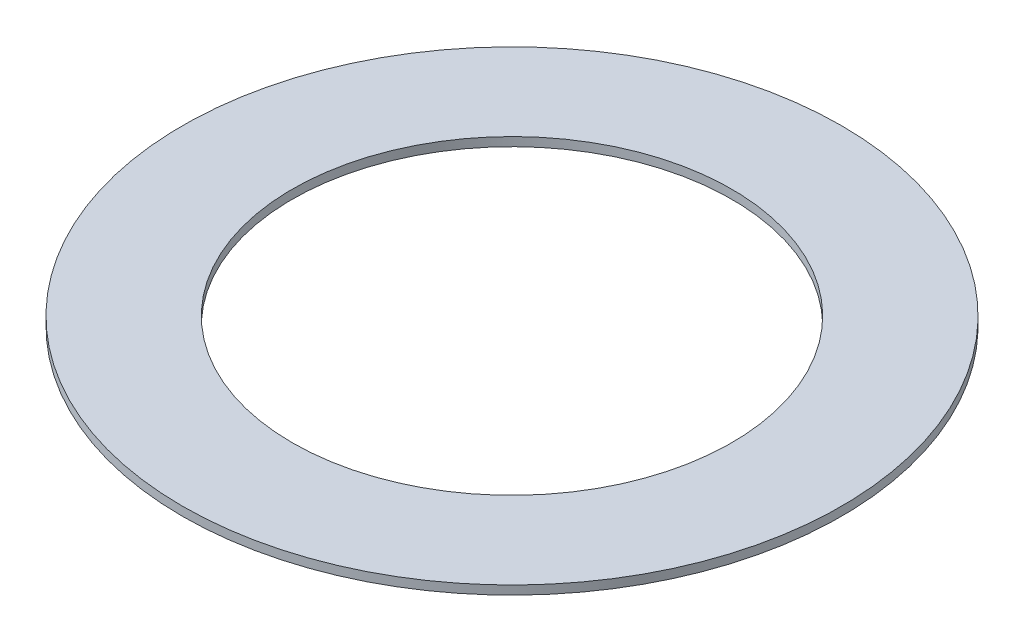
ISO-10303-21;
HEADER;
FILE_DESCRIPTION(('STEP AP214'),'2;1');
FILE_NAME('part.step','',(''),(''),'','','');
FILE_SCHEMA(('AUTOMOTIVE_DESIGN { 1 0 10303 214 1 1 1 1 }'));
ENDSEC;
DATA;
#1=APPLICATION_CONTEXT('core data for automotive mechanical design processes');
#2=APPLICATION_PROTOCOL_DEFINITION('international standard','automotive_design',2000,#1);
#3=PRODUCT_CONTEXT('',#1,'mechanical');
#4=PRODUCT('Part','Part','',(#3));
#5=PRODUCT_RELATED_PRODUCT_CATEGORY('part','',(#4));
#6=PRODUCT_DEFINITION_FORMATION('','',#4);
#7=PRODUCT_DEFINITION_CONTEXT('part definition',#1,'design');
#8=PRODUCT_DEFINITION('design','',#6,#7);
#9=PRODUCT_DEFINITION_SHAPE('','',#8);
#10=(LENGTH_UNIT() NAMED_UNIT(*) SI_UNIT(.MILLI.,.METRE.));
#11=(NAMED_UNIT(*) PLANE_ANGLE_UNIT() SI_UNIT($,.RADIAN.));
#12=(NAMED_UNIT(*) SI_UNIT($,.STERADIAN.) SOLID_ANGLE_UNIT());
#13=UNCERTAINTY_MEASURE_WITH_UNIT(LENGTH_MEASURE(1.E-05),#10,'distance_accuracy_value','');
#14=(GEOMETRIC_REPRESENTATION_CONTEXT(3) GLOBAL_UNCERTAINTY_ASSIGNED_CONTEXT((#13)) GLOBAL_UNIT_ASSIGNED_CONTEXT((#10,
#11,#12)) REPRESENTATION_CONTEXT('',''));
#15=CARTESIAN_POINT('',(0.,0.,0.));
#16=DIRECTION('',(0.,0.,1.));
#17=DIRECTION('',(1.,0.,0.));
#18=AXIS2_PLACEMENT_3D('',#15,#16,#17);
#19=CARTESIAN_POINT('',(0.,52.5,0.));
#20=DIRECTION('',(0.,1.,0.));
#21=DIRECTION('',(0.,0.,1.));
#22=AXIS2_PLACEMENT_3D('',#19,#20,#21);
#23=CYLINDRICAL_SURFACE('',#22,3.175);
#24=CARTESIAN_POINT('',(0.,0.127000000000002,0.));
#25=DIRECTION('',(0.,1.,0.));
#26=DIRECTION('',(0.,0.,1.));
#27=AXIS2_PLACEMENT_3D('',#24,#25,#26);
#28=CIRCLE('',#27,3.175);
#29=CARTESIAN_POINT('',(0.,0.127000000000002,3.175));
#30=VERTEX_POINT('',#29);
#31=EDGE_CURVE('E10',#30,#30,#28,.T.);
#32=ORIENTED_EDGE('',*,*,#31,.T.);
#33=EDGE_LOOP('',(#32));
#34=FACE_BOUND('',#33,.T.);
#35=CARTESIAN_POINT('',(0.,0.,0.));
#36=DIRECTION('',(0.,1.,0.));
#37=DIRECTION('',(0.,0.,1.));
#38=AXIS2_PLACEMENT_3D('',#35,#36,#37);
#39=CIRCLE('',#38,3.175);
#40=CARTESIAN_POINT('',(0.,0.,3.175));
#41=VERTEX_POINT('',#40);
#42=EDGE_CURVE('E56',#41,#41,#39,.T.);
#43=ORIENTED_EDGE('',*,*,#42,.F.);
#44=EDGE_LOOP('',(#43));
#45=FACE_BOUND('',#44,.T.);
#46=ADVANCED_FACE('F38',(#34,#45),#23,.F.);
#47=CARTESIAN_POINT('',(-3.175,0.127,0.));
#48=DIRECTION('',(0.,1.,0.));
#49=DIRECTION('',(0.,0.,1.));
#50=AXIS2_PLACEMENT_3D('',#47,#48,#49);
#51=PLANE('',#50);
#52=CARTESIAN_POINT('',(0.,0.127000000000002,0.));
#53=DIRECTION('',(0.,1.,0.));
#54=DIRECTION('',(0.,0.,1.));
#55=AXIS2_PLACEMENT_3D('',#52,#53,#54);
#56=CIRCLE('',#55,4.7625);
#57=CARTESIAN_POINT('',(0.,0.127000000000002,4.7625));
#58=VERTEX_POINT('',#57);
#59=EDGE_CURVE('E45',#58,#58,#56,.T.);
#60=ORIENTED_EDGE('',*,*,#59,.T.);
#61=EDGE_LOOP('',(#60));
#62=FACE_BOUND('',#61,.T.);
#63=ORIENTED_EDGE('',*,*,#31,.F.);
#64=EDGE_LOOP('',(#63));
#65=FACE_BOUND('',#64,.T.);
#66=ADVANCED_FACE('F66',(#62,#65),#51,.T.);
#67=CARTESIAN_POINT('',(0.,52.5,0.));
#68=DIRECTION('',(0.,1.,0.));
#69=DIRECTION('',(0.,0.,1.));
#70=AXIS2_PLACEMENT_3D('',#67,#68,#69);
#71=CYLINDRICAL_SURFACE('',#70,4.7625);
#72=CARTESIAN_POINT('',(0.,0.,0.));
#73=DIRECTION('',(0.,1.,0.));
#74=DIRECTION('',(0.,0.,1.));
#75=AXIS2_PLACEMENT_3D('',#72,#73,#74);
#76=CIRCLE('',#75,4.7625);
#77=CARTESIAN_POINT('',(0.,0.,4.7625));
#78=VERTEX_POINT('',#77);
#79=EDGE_CURVE('E51',#78,#78,#76,.T.);
#80=ORIENTED_EDGE('',*,*,#79,.T.);
#81=EDGE_LOOP('',(#80));
#82=FACE_BOUND('',#81,.T.);
#83=ORIENTED_EDGE('',*,*,#59,.F.);
#84=EDGE_LOOP('',(#83));
#85=FACE_BOUND('',#84,.T.);
#86=ADVANCED_FACE('F70',(#82,#85),#71,.T.);
#87=CARTESIAN_POINT('',(-3.175,0.,0.));
#88=DIRECTION('',(0.,-1.,0.));
#89=DIRECTION('',(0.,0.,-1.));
#90=AXIS2_PLACEMENT_3D('',#87,#88,#89);
#91=PLANE('',#90);
#92=ORIENTED_EDGE('',*,*,#42,.T.);
#93=EDGE_LOOP('',(#92));
#94=FACE_BOUND('',#93,.T.);
#95=ORIENTED_EDGE('',*,*,#79,.F.);
#96=EDGE_LOOP('',(#95));
#97=FACE_BOUND('',#96,.T.);
#98=ADVANCED_FACE('F62',(#94,#97),#91,.T.);
#99=CLOSED_SHELL('',(#46,#66,#86,#98));
#100=MANIFOLD_SOLID_BREP('B2',#99);
#101=ADVANCED_BREP_SHAPE_REPRESENTATION('',(#18,#100),#14);
#102=SHAPE_DEFINITION_REPRESENTATION(#9,#101);
ENDSEC;
END-ISO-10303-21;
